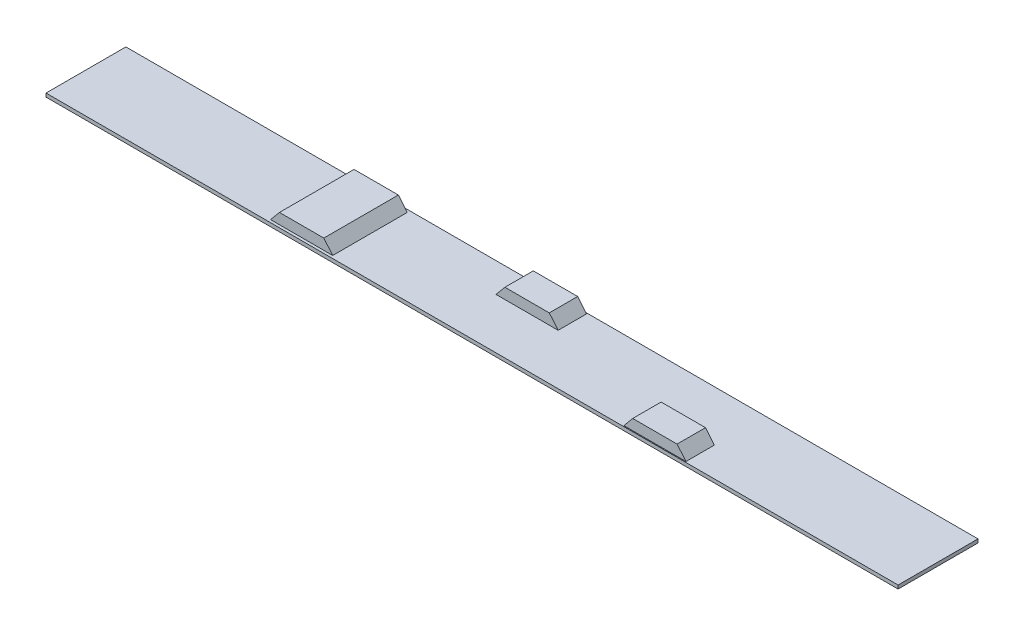
ISO-10303-21;
HEADER;
FILE_DESCRIPTION(('STEP AP214'),'2;1');
FILE_NAME('part.step','',(''),(''),'','','');
FILE_SCHEMA(('AUTOMOTIVE_DESIGN { 1 0 10303 214 1 1 1 1 }'));
ENDSEC;
DATA;
#1=APPLICATION_CONTEXT('core data for automotive mechanical design processes');
#2=APPLICATION_PROTOCOL_DEFINITION('international standard','automotive_design',2000,#1);
#3=PRODUCT_CONTEXT('',#1,'mechanical');
#4=PRODUCT('Part','Part','',(#3));
#5=PRODUCT_RELATED_PRODUCT_CATEGORY('part','',(#4));
#6=PRODUCT_DEFINITION_FORMATION('','',#4);
#7=PRODUCT_DEFINITION_CONTEXT('part definition',#1,'design');
#8=PRODUCT_DEFINITION('design','',#6,#7);
#9=PRODUCT_DEFINITION_SHAPE('','',#8);
#10=(LENGTH_UNIT() NAMED_UNIT(*) SI_UNIT(.MILLI.,.METRE.));
#11=(NAMED_UNIT(*) PLANE_ANGLE_UNIT() SI_UNIT($,.RADIAN.));
#12=(NAMED_UNIT(*) SI_UNIT($,.STERADIAN.) SOLID_ANGLE_UNIT());
#13=UNCERTAINTY_MEASURE_WITH_UNIT(LENGTH_MEASURE(1.E-05),#10,'distance_accuracy_value','');
#14=(GEOMETRIC_REPRESENTATION_CONTEXT(3) GLOBAL_UNCERTAINTY_ASSIGNED_CONTEXT((#13)) GLOBAL_UNIT_ASSIGNED_CONTEXT((#10,
#11,#12)) REPRESENTATION_CONTEXT('',''));
#15=CARTESIAN_POINT('',(0.,0.,0.));
#16=DIRECTION('',(0.,0.,1.));
#17=DIRECTION('',(1.,0.,0.));
#18=AXIS2_PLACEMENT_3D('',#15,#16,#17);
#19=CARTESIAN_POINT('',(0.,10.,0.));
#20=DIRECTION('',(0.,1.,0.));
#21=DIRECTION('',(0.,0.,1.));
#22=AXIS2_PLACEMENT_3D('',#19,#20,#21);
#23=PLANE('',#22);
#24=DIRECTION('',(0.,0.,-1.));
#25=VECTOR('',#24,1.);
#26=CARTESIAN_POINT('',(1200.,10.,-112.5));
#27=LINE('',#26,#25);
#28=CARTESIAN_POINT('',(1200.,10.,112.5));
#29=VERTEX_POINT('',#28);
#30=CARTESIAN_POINT('',(1200.,10.,-112.5));
#31=VERTEX_POINT('',#30);
#32=EDGE_CURVE('E291',#29,#31,#27,.T.);
#33=ORIENTED_EDGE('',*,*,#32,.T.);
#34=DIRECTION('',(-1.,0.,0.));
#35=VECTOR('',#34,1.);
#36=CARTESIAN_POINT('',(-1200.,10.,-112.5));
#37=LINE('',#36,#35);
#38=CARTESIAN_POINT('',(-1200.,10.,-112.5));
#39=VERTEX_POINT('',#38);
#40=EDGE_CURVE('E295',#31,#39,#37,.T.);
#41=ORIENTED_EDGE('',*,*,#40,.T.);
#42=DIRECTION('',(0.,0.,1.));
#43=VECTOR('',#42,1.);
#44=CARTESIAN_POINT('',(-1200.,10.,-112.5));
#45=LINE('',#44,#43);
#46=CARTESIAN_POINT('',(-1200.,10.,112.5));
#47=VERTEX_POINT('',#46);
#48=EDGE_CURVE('E299',#39,#47,#45,.T.);
#49=ORIENTED_EDGE('',*,*,#48,.T.);
#50=DIRECTION('',(1.,0.,0.));
#51=VECTOR('',#50,1.);
#52=CARTESIAN_POINT('',(-1200.,10.,112.5));
#53=LINE('',#52,#51);
#54=EDGE_CURVE('E302',#47,#29,#53,.T.);
#55=ORIENTED_EDGE('',*,*,#54,.T.);
#56=EDGE_LOOP('',(#33,#41,#49,#55));
#57=FACE_BOUND('',#56,.T.);
#58=DIRECTION('',(0.,0.,-1.));
#59=VECTOR('',#58,1.);
#60=CARTESIAN_POINT('',(600.,10.,110.));
#61=LINE('',#60,#59);
#62=CARTESIAN_POINT('',(600.,10.,110.));
#63=VERTEX_POINT('',#62);
#64=CARTESIAN_POINT('',(600.,10.,30.));
#65=VERTEX_POINT('',#64);
#66=EDGE_CURVE('E286',#63,#65,#61,.T.);
#67=ORIENTED_EDGE('',*,*,#66,.F.);
#68=DIRECTION('',(1.,0.,0.));
#69=VECTOR('',#68,1.);
#70=CARTESIAN_POINT('',(600.,10.,110.));
#71=LINE('',#70,#69);
#72=CARTESIAN_POINT('',(425.,10.,110.));
#73=VERTEX_POINT('',#72);
#74=EDGE_CURVE('E249',#73,#63,#71,.T.);
#75=ORIENTED_EDGE('',*,*,#74,.F.);
#76=DIRECTION('',(0.,0.,-1.));
#77=VECTOR('',#76,1.);
#78=CARTESIAN_POINT('',(425.,10.,110.));
#79=LINE('',#78,#77);
#80=CARTESIAN_POINT('',(425.,10.,30.));
#81=VERTEX_POINT('',#80);
#82=EDGE_CURVE('E264',#73,#81,#79,.T.);
#83=ORIENTED_EDGE('',*,*,#82,.T.);
#84=DIRECTION('',(1.,0.,0.));
#85=VECTOR('',#84,1.);
#86=CARTESIAN_POINT('',(600.,10.,30.));
#87=LINE('',#86,#85);
#88=EDGE_CURVE('E239',#81,#65,#87,.T.);
#89=ORIENTED_EDGE('',*,*,#88,.T.);
#90=EDGE_LOOP('',(#67,#75,#83,#89));
#91=FACE_BOUND('',#90,.T.);
#92=DIRECTION('',(0.,0.,1.));
#93=VECTOR('',#92,1.);
#94=CARTESIAN_POINT('',(-74.9999999999997,9.99999999999651,-110.));
#95=LINE('',#94,#93);
#96=CARTESIAN_POINT('',(-74.9999999999968,10.,-110.));
#97=VERTEX_POINT('',#96);
#98=CARTESIAN_POINT('',(-74.9999999999997,10.,-30.));
#99=VERTEX_POINT('',#98);
#100=EDGE_CURVE('E240',#97,#99,#95,.T.);
#101=ORIENTED_EDGE('',*,*,#100,.F.);
#102=DIRECTION('',(1.,0.,0.));
#103=VECTOR('',#102,1.);
#104=CARTESIAN_POINT('',(-74.9999999999997,9.99999999999651,-110.));
#105=LINE('',#104,#103);
#106=CARTESIAN_POINT('',(99.9999999999974,10.,-110.));
#107=VERTEX_POINT('',#106);
#108=EDGE_CURVE('E218',#97,#107,#105,.T.);
#109=ORIENTED_EDGE('',*,*,#108,.T.);
#110=DIRECTION('',(0.,0.,1.));
#111=VECTOR('',#110,1.);
#112=CARTESIAN_POINT('',(100.,9.99999999999651,-110.));
#113=LINE('',#112,#111);
#114=CARTESIAN_POINT('',(100.,9.99999999999651,-30.));
#115=VERTEX_POINT('',#114);
#116=EDGE_CURVE('E236',#107,#115,#113,.T.);
#117=ORIENTED_EDGE('',*,*,#116,.T.);
#118=DIRECTION('',(1.,0.,0.));
#119=VECTOR('',#118,1.);
#120=CARTESIAN_POINT('',(-74.9999999999997,9.99999999999651,-30.));
#121=LINE('',#120,#119);
#122=EDGE_CURVE('E210',#99,#115,#121,.T.);
#123=ORIENTED_EDGE('',*,*,#122,.F.);
#124=EDGE_LOOP('',(#101,#109,#117,#123));
#125=FACE_BOUND('',#124,.T.);
#126=DIRECTION('',(0.,0.,1.));
#127=VECTOR('',#126,1.);
#128=CARTESIAN_POINT('',(-575.,9.99999999999651,-105.));
#129=LINE('',#128,#127);
#130=CARTESIAN_POINT('',(-574.999999999997,10.,-105.));
#131=VERTEX_POINT('',#130);
#132=CARTESIAN_POINT('',(-575.,10.,105.));
#133=VERTEX_POINT('',#132);
#134=EDGE_CURVE('E61',#131,#133,#129,.T.);
#135=ORIENTED_EDGE('',*,*,#134,.F.);
#136=DIRECTION('',(1.,0.,0.));
#137=VECTOR('',#136,1.);
#138=CARTESIAN_POINT('',(-575.,9.99999999999651,-105.));
#139=LINE('',#138,#137);
#140=CARTESIAN_POINT('',(-400.000000000006,10.,-105.));
#141=VERTEX_POINT('',#140);
#142=EDGE_CURVE('E65',#131,#141,#139,.T.);
#143=ORIENTED_EDGE('',*,*,#142,.T.);
#144=DIRECTION('',(0.,0.,1.));
#145=VECTOR('',#144,1.);
#146=CARTESIAN_POINT('',(-400.,9.99999999999302,-105.));
#147=LINE('',#146,#145);
#148=CARTESIAN_POINT('',(-400.,9.99999999999302,105.));
#149=VERTEX_POINT('',#148);
#150=EDGE_CURVE('E154',#141,#149,#147,.T.);
#151=ORIENTED_EDGE('',*,*,#150,.T.);
#152=DIRECTION('',(1.,0.,0.));
#153=VECTOR('',#152,1.);
#154=CARTESIAN_POINT('',(-575.,9.99999999999651,105.));
#155=LINE('',#154,#153);
#156=EDGE_CURVE('E157',#133,#149,#155,.T.);
#157=ORIENTED_EDGE('',*,*,#156,.F.);
#158=EDGE_LOOP('',(#135,#143,#151,#157));
#159=FACE_BOUND('',#158,.T.);
#160=ADVANCED_FACE('F45',(#57,#91,#125,#159),#23,.T.);
#161=CARTESIAN_POINT('',(1200.,10.,-112.5));
#162=DIRECTION('',(-1.,0.,0.));
#163=DIRECTION('',(0.,0.,1.));
#164=AXIS2_PLACEMENT_3D('',#161,#162,#163);
#165=PLANE('',#164);
#166=DIRECTION('',(0.,0.,-1.));
#167=VECTOR('',#166,1.);
#168=CARTESIAN_POINT('',(1200.,0.,-112.5));
#169=LINE('',#168,#167);
#170=CARTESIAN_POINT('',(1200.,0.,112.5));
#171=VERTEX_POINT('',#170);
#172=CARTESIAN_POINT('',(1200.,0.,-112.5));
#173=VERTEX_POINT('',#172);
#174=EDGE_CURVE('E290',#171,#173,#169,.T.);
#175=ORIENTED_EDGE('',*,*,#174,.T.);
#176=DIRECTION('',(0.,-1.,0.));
#177=VECTOR('',#176,1.);
#178=CARTESIAN_POINT('',(1200.,10.,-112.5));
#179=LINE('',#178,#177);
#180=EDGE_CURVE('E11',#31,#173,#179,.T.);
#181=ORIENTED_EDGE('',*,*,#180,.F.);
#182=ORIENTED_EDGE('',*,*,#32,.F.);
#183=DIRECTION('',(0.,-1.,0.));
#184=VECTOR('',#183,1.);
#185=CARTESIAN_POINT('',(1200.,10.,112.5));
#186=LINE('',#185,#184);
#187=EDGE_CURVE('E305',#29,#171,#186,.T.);
#188=ORIENTED_EDGE('',*,*,#187,.T.);
#189=EDGE_LOOP('',(#175,#181,#182,#188));
#190=FACE_BOUND('',#189,.T.);
#191=ADVANCED_FACE('F47',(#190),#165,.F.);
#192=CARTESIAN_POINT('',(-1200.,10.,-112.5));
#193=DIRECTION('',(0.,0.,1.));
#194=DIRECTION('',(1.,0.,0.));
#195=AXIS2_PLACEMENT_3D('',#192,#193,#194);
#196=PLANE('',#195);
#197=DIRECTION('',(-1.,0.,0.));
#198=VECTOR('',#197,1.);
#199=CARTESIAN_POINT('',(-1200.,0.,-112.5));
#200=LINE('',#199,#198);
#201=CARTESIAN_POINT('',(-1200.,0.,-112.5));
#202=VERTEX_POINT('',#201);
#203=EDGE_CURVE('E309',#173,#202,#200,.T.);
#204=ORIENTED_EDGE('',*,*,#203,.T.);
#205=DIRECTION('',(0.,-1.,0.));
#206=VECTOR('',#205,1.);
#207=CARTESIAN_POINT('',(-1200.,10.,-112.5));
#208=LINE('',#207,#206);
#209=EDGE_CURVE('E54',#39,#202,#208,.T.);
#210=ORIENTED_EDGE('',*,*,#209,.F.);
#211=ORIENTED_EDGE('',*,*,#40,.F.);
#212=ORIENTED_EDGE('',*,*,#180,.T.);
#213=EDGE_LOOP('',(#204,#210,#211,#212));
#214=FACE_BOUND('',#213,.T.);
#215=ADVANCED_FACE('F345',(#214),#196,.F.);
#216=CARTESIAN_POINT('',(-1200.,10.,-112.5));
#217=DIRECTION('',(1.,0.,0.));
#218=DIRECTION('',(0.,0.,-1.));
#219=AXIS2_PLACEMENT_3D('',#216,#217,#218);
#220=PLANE('',#219);
#221=DIRECTION('',(0.,0.,1.));
#222=VECTOR('',#221,1.);
#223=CARTESIAN_POINT('',(-1200.,0.,-112.5));
#224=LINE('',#223,#222);
#225=CARTESIAN_POINT('',(-1200.,0.,112.5));
#226=VERTEX_POINT('',#225);
#227=EDGE_CURVE('E312',#202,#226,#224,.T.);
#228=ORIENTED_EDGE('',*,*,#227,.T.);
#229=DIRECTION('',(0.,-1.,0.));
#230=VECTOR('',#229,1.);
#231=CARTESIAN_POINT('',(-1200.,10.,112.5));
#232=LINE('',#231,#230);
#233=EDGE_CURVE('E320',#47,#226,#232,.T.);
#234=ORIENTED_EDGE('',*,*,#233,.F.);
#235=ORIENTED_EDGE('',*,*,#48,.F.);
#236=ORIENTED_EDGE('',*,*,#209,.T.);
#237=EDGE_LOOP('',(#228,#234,#235,#236));
#238=FACE_BOUND('',#237,.T.);
#239=ADVANCED_FACE('F329',(#238),#220,.F.);
#240=CARTESIAN_POINT('',(-1200.,10.,112.5));
#241=DIRECTION('',(0.,0.,-1.));
#242=DIRECTION('',(-1.,0.,0.));
#243=AXIS2_PLACEMENT_3D('',#240,#241,#242);
#244=PLANE('',#243);
#245=DIRECTION('',(1.,0.,0.));
#246=VECTOR('',#245,1.);
#247=CARTESIAN_POINT('',(-1200.,0.,112.5));
#248=LINE('',#247,#246);
#249=EDGE_CURVE('E296',#226,#171,#248,.T.);
#250=ORIENTED_EDGE('',*,*,#249,.T.);
#251=ORIENTED_EDGE('',*,*,#187,.F.);
#252=ORIENTED_EDGE('',*,*,#54,.F.);
#253=ORIENTED_EDGE('',*,*,#233,.T.);
#254=EDGE_LOOP('',(#250,#251,#252,#253));
#255=FACE_BOUND('',#254,.T.);
#256=ADVANCED_FACE('F338',(#255),#244,.F.);
#257=CARTESIAN_POINT('',(0.,0.,0.));
#258=DIRECTION('',(0.,1.,0.));
#259=DIRECTION('',(0.,0.,1.));
#260=AXIS2_PLACEMENT_3D('',#257,#258,#259);
#261=PLANE('',#260);
#262=ORIENTED_EDGE('',*,*,#174,.F.);
#263=ORIENTED_EDGE('',*,*,#249,.F.);
#264=ORIENTED_EDGE('',*,*,#227,.F.);
#265=ORIENTED_EDGE('',*,*,#203,.F.);
#266=EDGE_LOOP('',(#262,#263,#264,#265));
#267=FACE_BOUND('',#266,.T.);
#268=ADVANCED_FACE('F335',(#267),#261,.F.);
#269=CARTESIAN_POINT('',(575.,40.,110.));
#270=DIRECTION('',(-0.768221279597376,-0.64018439966448,0.));
#271=DIRECTION('',(0.64018439966448,-0.768221279597376,0.));
#272=AXIS2_PLACEMENT_3D('',#269,#270,#271);
#273=PLANE('',#272);
#274=DIRECTION('',(-0.64018439966448,0.768221279597375,0.));
#275=VECTOR('',#274,1.);
#276=CARTESIAN_POINT('',(575.,40.,30.));
#277=LINE('',#276,#275);
#278=CARTESIAN_POINT('',(575.,40.,30.));
#279=VERTEX_POINT('',#278);
#280=EDGE_CURVE('E267',#65,#279,#277,.T.);
#281=ORIENTED_EDGE('',*,*,#280,.T.);
#282=DIRECTION('',(0.,0.,-1.));
#283=VECTOR('',#282,1.);
#284=CARTESIAN_POINT('',(575.,40.,110.));
#285=LINE('',#284,#283);
#286=CARTESIAN_POINT('',(575.,40.,110.));
#287=VERTEX_POINT('',#286);
#288=EDGE_CURVE('E282',#287,#279,#285,.T.);
#289=ORIENTED_EDGE('',*,*,#288,.F.);
#290=DIRECTION('',(-0.64018439966448,0.768221279597375,0.));
#291=VECTOR('',#290,1.);
#292=CARTESIAN_POINT('',(575.,40.,110.));
#293=LINE('',#292,#291);
#294=EDGE_CURVE('E253',#63,#287,#293,.T.);
#295=ORIENTED_EDGE('',*,*,#294,.F.);
#296=ORIENTED_EDGE('',*,*,#66,.T.);
#297=EDGE_LOOP('',(#281,#289,#295,#296));
#298=FACE_BOUND('',#297,.T.);
#299=ADVANCED_FACE('F358',(#298),#273,.F.);
#300=CARTESIAN_POINT('',(450.,40.,110.));
#301=DIRECTION('',(0.,-1.,0.));
#302=DIRECTION('',(0.,0.,-1.));
#303=AXIS2_PLACEMENT_3D('',#300,#301,#302);
#304=PLANE('',#303);
#305=DIRECTION('',(-1.,0.,0.));
#306=VECTOR('',#305,1.);
#307=CARTESIAN_POINT('',(450.,40.,30.));
#308=LINE('',#307,#306);
#309=CARTESIAN_POINT('',(450.,40.,30.));
#310=VERTEX_POINT('',#309);
#311=EDGE_CURVE('E270',#279,#310,#308,.T.);
#312=ORIENTED_EDGE('',*,*,#311,.T.);
#313=DIRECTION('',(0.,0.,-1.));
#314=VECTOR('',#313,1.);
#315=CARTESIAN_POINT('',(450.,40.,110.));
#316=LINE('',#315,#314);
#317=CARTESIAN_POINT('',(450.,40.,110.));
#318=VERTEX_POINT('',#317);
#319=EDGE_CURVE('E278',#318,#310,#316,.T.);
#320=ORIENTED_EDGE('',*,*,#319,.F.);
#321=DIRECTION('',(-1.,0.,0.));
#322=VECTOR('',#321,1.);
#323=CARTESIAN_POINT('',(450.,40.,110.));
#324=LINE('',#323,#322);
#325=EDGE_CURVE('E257',#287,#318,#324,.T.);
#326=ORIENTED_EDGE('',*,*,#325,.F.);
#327=ORIENTED_EDGE('',*,*,#288,.T.);
#328=EDGE_LOOP('',(#312,#320,#326,#327));
#329=FACE_BOUND('',#328,.T.);
#330=ADVANCED_FACE('F377',(#329),#304,.F.);
#331=CARTESIAN_POINT('',(425.,10.,110.));
#332=DIRECTION('',(0.768221279597376,-0.64018439966448,0.));
#333=DIRECTION('',(0.64018439966448,0.768221279597376,0.));
#334=AXIS2_PLACEMENT_3D('',#331,#332,#333);
#335=PLANE('',#334);
#336=DIRECTION('',(-0.64018439966448,-0.768221279597375,0.));
#337=VECTOR('',#336,1.);
#338=CARTESIAN_POINT('',(425.,10.,30.));
#339=LINE('',#338,#337);
#340=EDGE_CURVE('E254',#310,#81,#339,.T.);
#341=ORIENTED_EDGE('',*,*,#340,.T.);
#342=ORIENTED_EDGE('',*,*,#82,.F.);
#343=DIRECTION('',(-0.64018439966448,-0.768221279597375,0.));
#344=VECTOR('',#343,1.);
#345=CARTESIAN_POINT('',(425.,10.,110.));
#346=LINE('',#345,#344);
#347=EDGE_CURVE('E260',#318,#73,#346,.T.);
#348=ORIENTED_EDGE('',*,*,#347,.F.);
#349=ORIENTED_EDGE('',*,*,#319,.T.);
#350=EDGE_LOOP('',(#341,#342,#348,#349));
#351=FACE_BOUND('',#350,.T.);
#352=ADVANCED_FACE('F384',(#351),#335,.F.);
#353=CARTESIAN_POINT('',(0.,0.,110.));
#354=DIRECTION('',(0.,0.,-1.));
#355=DIRECTION('',(-1.,0.,0.));
#356=AXIS2_PLACEMENT_3D('',#353,#354,#355);
#357=PLANE('',#356);
#358=ORIENTED_EDGE('',*,*,#74,.T.);
#359=ORIENTED_EDGE('',*,*,#294,.T.);
#360=ORIENTED_EDGE('',*,*,#325,.T.);
#361=ORIENTED_EDGE('',*,*,#347,.T.);
#362=EDGE_LOOP('',(#358,#359,#360,#361));
#363=FACE_BOUND('',#362,.T.);
#364=ADVANCED_FACE('F391',(#363),#357,.F.);
#365=CARTESIAN_POINT('',(0.,0.,30.));
#366=DIRECTION('',(0.,0.,-1.));
#367=DIRECTION('',(-1.,0.,0.));
#368=AXIS2_PLACEMENT_3D('',#365,#366,#367);
#369=PLANE('',#368);
#370=ORIENTED_EDGE('',*,*,#88,.F.);
#371=ORIENTED_EDGE('',*,*,#340,.F.);
#372=ORIENTED_EDGE('',*,*,#311,.F.);
#373=ORIENTED_EDGE('',*,*,#280,.F.);
#374=EDGE_LOOP('',(#370,#371,#372,#373));
#375=FACE_BOUND('',#374,.T.);
#376=ADVANCED_FACE('F399',(#375),#369,.T.);
#377=CARTESIAN_POINT('',(100.,9.99999999999651,-110.));
#378=DIRECTION('',(0.768221279597376,0.64018439966448,0.));
#379=DIRECTION('',(-0.64018439966448,0.768221279597376,0.));
#380=AXIS2_PLACEMENT_3D('',#377,#378,#379);
#381=PLANE('',#380);
#382=DIRECTION('',(-0.64018439966448,0.768221279597376,0.));
#383=VECTOR('',#382,1.);
#384=CARTESIAN_POINT('',(100.,9.99999999999651,-30.));
#385=LINE('',#384,#383);
#386=CARTESIAN_POINT('',(75.0000000000003,39.9999999999965,-30.));
#387=VERTEX_POINT('',#386);
#388=EDGE_CURVE('E199',#115,#387,#385,.T.);
#389=ORIENTED_EDGE('',*,*,#388,.F.);
#390=ORIENTED_EDGE('',*,*,#116,.F.);
#391=DIRECTION('',(-0.64018439966448,0.768221279597376,0.));
#392=VECTOR('',#391,1.);
#393=CARTESIAN_POINT('',(100.,9.99999999999651,-110.));
#394=LINE('',#393,#392);
#395=CARTESIAN_POINT('',(75.0000000000003,39.9999999999965,-110.));
#396=VERTEX_POINT('',#395);
#397=EDGE_CURVE('E205',#107,#396,#394,.T.);
#398=ORIENTED_EDGE('',*,*,#397,.T.);
#399=DIRECTION('',(0.,0.,1.));
#400=VECTOR('',#399,1.);
#401=CARTESIAN_POINT('',(75.0000000000003,39.9999999999965,-110.));
#402=LINE('',#401,#400);
#403=EDGE_CURVE('E221',#396,#387,#402,.T.);
#404=ORIENTED_EDGE('',*,*,#403,.T.);
#405=EDGE_LOOP('',(#389,#390,#398,#404));
#406=FACE_BOUND('',#405,.T.);
#407=ADVANCED_FACE('F407',(#406),#381,.T.);
#408=CARTESIAN_POINT('',(-49.9999999999997,39.9999999999965,-110.));
#409=DIRECTION('',(-0.768221279597376,0.64018439966448,0.));
#410=DIRECTION('',(-0.64018439966448,-0.768221279597376,0.));
#411=AXIS2_PLACEMENT_3D('',#408,#409,#410);
#412=PLANE('',#411);
#413=DIRECTION('',(-0.64018439966448,-0.768221279597376,0.));
#414=VECTOR('',#413,1.);
#415=CARTESIAN_POINT('',(-49.9999999999997,39.9999999999965,-30.));
#416=LINE('',#415,#414);
#417=CARTESIAN_POINT('',(-49.9999999999997,39.9999999999965,-30.));
#418=VERTEX_POINT('',#417);
#419=EDGE_CURVE('E229',#418,#99,#416,.T.);
#420=ORIENTED_EDGE('',*,*,#419,.F.);
#421=DIRECTION('',(0.,0.,1.));
#422=VECTOR('',#421,1.);
#423=CARTESIAN_POINT('',(-49.9999999999997,39.9999999999965,-110.));
#424=LINE('',#423,#422);
#425=CARTESIAN_POINT('',(-49.9999999999997,39.9999999999965,-110.));
#426=VERTEX_POINT('',#425);
#427=EDGE_CURVE('E244',#426,#418,#424,.T.);
#428=ORIENTED_EDGE('',*,*,#427,.F.);
#429=DIRECTION('',(-0.64018439966448,-0.768221279597376,0.));
#430=VECTOR('',#429,1.);
#431=CARTESIAN_POINT('',(-49.9999999999997,39.9999999999965,-110.));
#432=LINE('',#431,#430);
#433=EDGE_CURVE('E214',#426,#97,#432,.T.);
#434=ORIENTED_EDGE('',*,*,#433,.T.);
#435=ORIENTED_EDGE('',*,*,#100,.T.);
#436=EDGE_LOOP('',(#420,#428,#434,#435));
#437=FACE_BOUND('',#436,.T.);
#438=ADVANCED_FACE('F415',(#437),#412,.T.);
#439=CARTESIAN_POINT('',(75.0000000000003,39.9999999999965,-110.));
#440=DIRECTION('',(0.,1.,0.));
#441=DIRECTION('',(0.,0.,1.));
#442=AXIS2_PLACEMENT_3D('',#439,#440,#441);
#443=PLANE('',#442);
#444=DIRECTION('',(-1.,0.,0.));
#445=VECTOR('',#444,1.);
#446=CARTESIAN_POINT('',(75.0000000000003,39.9999999999965,-30.));
#447=LINE('',#446,#445);
#448=EDGE_CURVE('E225',#387,#418,#447,.T.);
#449=ORIENTED_EDGE('',*,*,#448,.F.);
#450=ORIENTED_EDGE('',*,*,#403,.F.);
#451=DIRECTION('',(-1.,0.,0.));
#452=VECTOR('',#451,1.);
#453=CARTESIAN_POINT('',(75.0000000000003,39.9999999999965,-110.));
#454=LINE('',#453,#452);
#455=EDGE_CURVE('E209',#396,#426,#454,.T.);
#456=ORIENTED_EDGE('',*,*,#455,.T.);
#457=ORIENTED_EDGE('',*,*,#427,.T.);
#458=EDGE_LOOP('',(#449,#450,#456,#457));
#459=FACE_BOUND('',#458,.T.);
#460=ADVANCED_FACE('F423',(#459),#443,.T.);
#461=CARTESIAN_POINT('',(0.,0.,-110.));
#462=DIRECTION('',(0.,0.,1.));
#463=DIRECTION('',(1.,0.,0.));
#464=AXIS2_PLACEMENT_3D('',#461,#462,#463);
#465=PLANE('',#464);
#466=ORIENTED_EDGE('',*,*,#397,.F.);
#467=ORIENTED_EDGE('',*,*,#108,.F.);
#468=ORIENTED_EDGE('',*,*,#433,.F.);
#469=ORIENTED_EDGE('',*,*,#455,.F.);
#470=EDGE_LOOP('',(#466,#467,#468,#469));
#471=FACE_BOUND('',#470,.T.);
#472=ADVANCED_FACE('F431',(#471),#465,.F.);
#473=CARTESIAN_POINT('',(0.,0.,-30.));
#474=DIRECTION('',(0.,0.,1.));
#475=DIRECTION('',(1.,0.,0.));
#476=AXIS2_PLACEMENT_3D('',#473,#474,#475);
#477=PLANE('',#476);
#478=ORIENTED_EDGE('',*,*,#388,.T.);
#479=ORIENTED_EDGE('',*,*,#448,.T.);
#480=ORIENTED_EDGE('',*,*,#419,.T.);
#481=ORIENTED_EDGE('',*,*,#122,.T.);
#482=EDGE_LOOP('',(#478,#479,#480,#481));
#483=FACE_BOUND('',#482,.T.);
#484=ADVANCED_FACE('F439',(#483),#477,.T.);
#485=CARTESIAN_POINT('',(-550.,39.999999999993,-105.));
#486=DIRECTION('',(-0.768221279597339,0.640184399664524,0.));
#487=DIRECTION('',(-0.640184399664524,-0.768221279597339,0.));
#488=AXIS2_PLACEMENT_3D('',#485,#486,#487);
#489=PLANE('',#488);
#490=ORIENTED_EDGE('',*,*,#134,.T.);
#491=DIRECTION('',(-0.640184399664524,-0.768221279597339,0.));
#492=VECTOR('',#491,1.);
#493=CARTESIAN_POINT('',(-550.,39.999999999993,105.));
#494=LINE('',#493,#492);
#495=CARTESIAN_POINT('',(-550.,39.999999999993,105.));
#496=VERTEX_POINT('',#495);
#497=EDGE_CURVE('E177',#496,#133,#494,.T.);
#498=ORIENTED_EDGE('',*,*,#497,.F.);
#499=DIRECTION('',(0.,0.,1.));
#500=VECTOR('',#499,1.);
#501=CARTESIAN_POINT('',(-550.,39.999999999993,-105.));
#502=LINE('',#501,#500);
#503=CARTESIAN_POINT('',(-550.,39.999999999993,-105.));
#504=VERTEX_POINT('',#503);
#505=EDGE_CURVE('E200',#504,#496,#502,.T.);
#506=ORIENTED_EDGE('',*,*,#505,.F.);
#507=DIRECTION('',(-0.640184399664524,-0.768221279597339,0.));
#508=VECTOR('',#507,1.);
#509=CARTESIAN_POINT('',(-550.,39.999999999993,-105.));
#510=LINE('',#509,#508);
#511=EDGE_CURVE('E163',#504,#131,#510,.T.);
#512=ORIENTED_EDGE('',*,*,#511,.T.);
#513=EDGE_LOOP('',(#490,#498,#506,#512));
#514=FACE_BOUND('',#513,.T.);
#515=ADVANCED_FACE('F447',(#514),#489,.T.);
#516=CARTESIAN_POINT('',(-425.,39.999999999993,-105.));
#517=DIRECTION('',(0.,1.,0.));
#518=DIRECTION('',(0.,0.,1.));
#519=AXIS2_PLACEMENT_3D('',#516,#517,#518);
#520=PLANE('',#519);
#521=ORIENTED_EDGE('',*,*,#505,.T.);
#522=DIRECTION('',(-1.,0.,0.));
#523=VECTOR('',#522,1.);
#524=CARTESIAN_POINT('',(-425.,39.999999999993,105.));
#525=LINE('',#524,#523);
#526=CARTESIAN_POINT('',(-425.,39.999999999993,105.));
#527=VERTEX_POINT('',#526);
#528=EDGE_CURVE('E172',#527,#496,#525,.T.);
#529=ORIENTED_EDGE('',*,*,#528,.F.);
#530=DIRECTION('',(0.,0.,1.));
#531=VECTOR('',#530,1.);
#532=CARTESIAN_POINT('',(-425.,39.999999999993,-105.));
#533=LINE('',#532,#531);
#534=CARTESIAN_POINT('',(-425.,39.999999999993,-105.));
#535=VERTEX_POINT('',#534);
#536=EDGE_CURVE('E162',#535,#527,#533,.T.);
#537=ORIENTED_EDGE('',*,*,#536,.F.);
#538=DIRECTION('',(-1.,0.,0.));
#539=VECTOR('',#538,1.);
#540=CARTESIAN_POINT('',(-425.,39.999999999993,-105.));
#541=LINE('',#540,#539);
#542=EDGE_CURVE('E190',#535,#504,#541,.T.);
#543=ORIENTED_EDGE('',*,*,#542,.T.);
#544=EDGE_LOOP('',(#521,#529,#537,#543));
#545=FACE_BOUND('',#544,.T.);
#546=ADVANCED_FACE('F455',(#545),#520,.T.);
#547=CARTESIAN_POINT('',(-400.,9.99999999999302,-105.));
#548=DIRECTION('',(0.768221279597376,0.64018439966448,0.));
#549=DIRECTION('',(-0.64018439966448,0.768221279597376,0.));
#550=AXIS2_PLACEMENT_3D('',#547,#548,#549);
#551=PLANE('',#550);
#552=ORIENTED_EDGE('',*,*,#536,.T.);
#553=DIRECTION('',(-0.64018439966448,0.768221279597376,0.));
#554=VECTOR('',#553,1.);
#555=CARTESIAN_POINT('',(-400.,9.99999999999302,105.));
#556=LINE('',#555,#554);
#557=EDGE_CURVE('E166',#149,#527,#556,.T.);
#558=ORIENTED_EDGE('',*,*,#557,.F.);
#559=ORIENTED_EDGE('',*,*,#150,.F.);
#560=DIRECTION('',(-0.64018439966448,0.768221279597376,0.));
#561=VECTOR('',#560,1.);
#562=CARTESIAN_POINT('',(-400.,9.99999999999302,-105.));
#563=LINE('',#562,#561);
#564=EDGE_CURVE('E187',#141,#535,#563,.T.);
#565=ORIENTED_EDGE('',*,*,#564,.T.);
#566=EDGE_LOOP('',(#552,#558,#559,#565));
#567=FACE_BOUND('',#566,.T.);
#568=ADVANCED_FACE('F167',(#567),#551,.T.);
#569=CARTESIAN_POINT('',(0.,0.,-105.));
#570=DIRECTION('',(0.,0.,1.));
#571=DIRECTION('',(1.,0.,0.));
#572=AXIS2_PLACEMENT_3D('',#569,#570,#571);
#573=PLANE('',#572);
#574=ORIENTED_EDGE('',*,*,#142,.F.);
#575=ORIENTED_EDGE('',*,*,#511,.F.);
#576=ORIENTED_EDGE('',*,*,#542,.F.);
#577=ORIENTED_EDGE('',*,*,#564,.F.);
#578=EDGE_LOOP('',(#574,#575,#576,#577));
#579=FACE_BOUND('',#578,.T.);
#580=ADVANCED_FACE('F470',(#579),#573,.F.);
#581=CARTESIAN_POINT('',(0.,0.,105.));
#582=DIRECTION('',(0.,0.,1.));
#583=DIRECTION('',(1.,0.,0.));
#584=AXIS2_PLACEMENT_3D('',#581,#582,#583);
#585=PLANE('',#584);
#586=ORIENTED_EDGE('',*,*,#156,.T.);
#587=ORIENTED_EDGE('',*,*,#557,.T.);
#588=ORIENTED_EDGE('',*,*,#528,.T.);
#589=ORIENTED_EDGE('',*,*,#497,.T.);
#590=EDGE_LOOP('',(#586,#587,#588,#589));
#591=FACE_BOUND('',#590,.T.);
#592=ADVANCED_FACE('F175',(#591),#585,.T.);
#593=CLOSED_SHELL('',(#160,#191,#215,#239,#256,#268,#299,#330,#352,#364,#376,#407,#438,#460,
#472,#484,#515,#546,#568,#580,#592));
#594=MANIFOLD_SOLID_BREP('B2',#593);
#595=ADVANCED_BREP_SHAPE_REPRESENTATION('',(#18,#594),#14);
#596=SHAPE_DEFINITION_REPRESENTATION(#9,#595);
ENDSEC;
END-ISO-10303-21;
